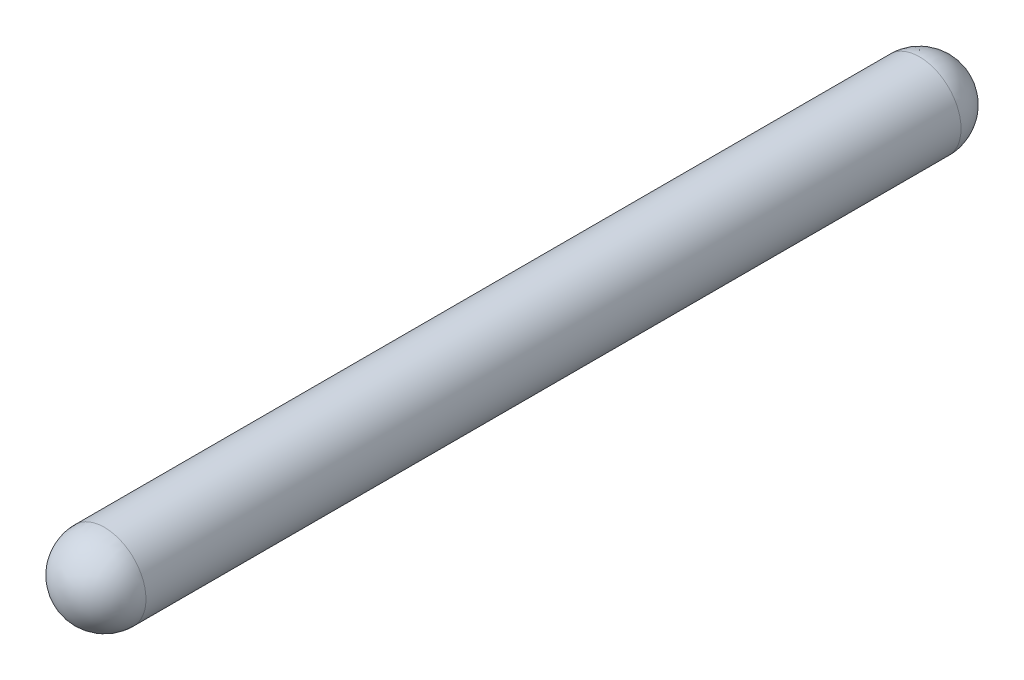
ISO-10303-21;
HEADER;
FILE_DESCRIPTION(('STEP AP214'),'2;1');
FILE_NAME('part.step','',(''),(''),'','','');
FILE_SCHEMA(('AUTOMOTIVE_DESIGN { 1 0 10303 214 1 1 1 1 }'));
ENDSEC;
DATA;
#1=APPLICATION_CONTEXT('core data for automotive mechanical design processes');
#2=APPLICATION_PROTOCOL_DEFINITION('international standard','automotive_design',2000,#1);
#3=PRODUCT_CONTEXT('',#1,'mechanical');
#4=PRODUCT('Part','Part','',(#3));
#5=PRODUCT_RELATED_PRODUCT_CATEGORY('part','',(#4));
#6=PRODUCT_DEFINITION_FORMATION('','',#4);
#7=PRODUCT_DEFINITION_CONTEXT('part definition',#1,'design');
#8=PRODUCT_DEFINITION('design','',#6,#7);
#9=PRODUCT_DEFINITION_SHAPE('','',#8);
#10=(LENGTH_UNIT() NAMED_UNIT(*) SI_UNIT(.MILLI.,.METRE.));
#11=(NAMED_UNIT(*) PLANE_ANGLE_UNIT() SI_UNIT($,.RADIAN.));
#12=(NAMED_UNIT(*) SI_UNIT($,.STERADIAN.) SOLID_ANGLE_UNIT());
#13=UNCERTAINTY_MEASURE_WITH_UNIT(LENGTH_MEASURE(1.E-05),#10,'distance_accuracy_value','');
#14=(GEOMETRIC_REPRESENTATION_CONTEXT(3) GLOBAL_UNCERTAINTY_ASSIGNED_CONTEXT((#13)) GLOBAL_UNIT_ASSIGNED_CONTEXT((#10,
#11,#12)) REPRESENTATION_CONTEXT('',''));
#15=CARTESIAN_POINT('',(0.,0.,0.));
#16=DIRECTION('',(0.,0.,1.));
#17=DIRECTION('',(1.,0.,0.));
#18=AXIS2_PLACEMENT_3D('',#15,#16,#17);
#19=CARTESIAN_POINT('',(-0.936,-16.31,-3.));
#20=DIRECTION('',(1.,0.,0.));
#21=DIRECTION('',(0.,-1.,0.));
#22=AXIS2_PLACEMENT_3D('',#19,#20,#21);
#23=SPHERICAL_SURFACE('',#22,0.331);
#24=CARTESIAN_POINT('',(-0.936,-16.31,-3.));
#25=DIRECTION('',(0.,0.,1.));
#26=DIRECTION('',(1.,0.,0.));
#27=AXIS2_PLACEMENT_3D('',#24,#25,#26);
#28=CIRCLE('',#27,0.331);
#29=CARTESIAN_POINT('',(-0.605,-16.31,-3.));
#30=VERTEX_POINT('',#29);
#31=CARTESIAN_POINT('',(-1.267,-16.31,-3.));
#32=VERTEX_POINT('',#31);
#33=EDGE_CURVE('E42',#30,#32,#28,.T.);
#34=ORIENTED_EDGE('',*,*,#33,.F.);
#35=CARTESIAN_POINT('',(-0.936,-16.31,-3.));
#36=DIRECTION('',(0.,0.,1.));
#37=DIRECTION('',(1.,0.,0.));
#38=AXIS2_PLACEMENT_3D('',#35,#36,#37);
#39=CIRCLE('',#38,0.331);
#40=EDGE_CURVE('E26',#32,#30,#39,.T.);
#41=ORIENTED_EDGE('',*,*,#40,.F.);
#42=EDGE_LOOP('',(#34,#41));
#43=FACE_BOUND('',#42,.T.);
#44=ADVANCED_FACE('F17',(#43),#23,.T.);
#45=CARTESIAN_POINT('',(-0.936,-16.31,3.5));
#46=DIRECTION('',(1.,0.,0.));
#47=DIRECTION('',(0.,1.,0.));
#48=AXIS2_PLACEMENT_3D('',#45,#46,#47);
#49=SPHERICAL_SURFACE('',#48,0.331);
#50=CARTESIAN_POINT('',(-0.936,-16.31,3.5));
#51=DIRECTION('',(0.,0.,1.));
#52=DIRECTION('',(1.,0.,0.));
#53=AXIS2_PLACEMENT_3D('',#50,#51,#52);
#54=CIRCLE('',#53,0.331);
#55=CARTESIAN_POINT('',(-0.605,-16.31,3.5));
#56=VERTEX_POINT('',#55);
#57=CARTESIAN_POINT('',(-1.267,-16.31,3.5));
#58=VERTEX_POINT('',#57);
#59=EDGE_CURVE('E11',#56,#58,#54,.F.);
#60=ORIENTED_EDGE('',*,*,#59,.F.);
#61=CARTESIAN_POINT('',(-0.936,-16.31,3.5));
#62=DIRECTION('',(0.,0.,1.));
#63=DIRECTION('',(1.,0.,0.));
#64=AXIS2_PLACEMENT_3D('',#61,#62,#63);
#65=CIRCLE('',#64,0.331);
#66=EDGE_CURVE('E34',#58,#56,#65,.F.);
#67=ORIENTED_EDGE('',*,*,#66,.F.);
#68=EDGE_LOOP('',(#60,#67));
#69=FACE_BOUND('',#68,.T.);
#70=ADVANCED_FACE('F49',(#69),#49,.T.);
#71=CARTESIAN_POINT('',(-0.936,-16.31,-3.));
#72=DIRECTION('',(0.,0.,1.));
#73=DIRECTION('',(1.,0.,0.));
#74=AXIS2_PLACEMENT_3D('',#71,#72,#73);
#75=CYLINDRICAL_SURFACE('',#74,0.331);
#76=ORIENTED_EDGE('',*,*,#66,.T.);
#77=ORIENTED_EDGE('',*,*,#59,.T.);
#78=EDGE_LOOP('',(#76,#77));
#79=FACE_BOUND('',#78,.T.);
#80=ORIENTED_EDGE('',*,*,#40,.T.);
#81=ORIENTED_EDGE('',*,*,#33,.T.);
#82=EDGE_LOOP('',(#80,#81));
#83=FACE_BOUND('',#82,.T.);
#84=ADVANCED_FACE('F45',(#79,#83),#75,.T.);
#85=CLOSED_SHELL('',(#44,#70,#84));
#86=MANIFOLD_SOLID_BREP('B1',#85);
#87=ADVANCED_BREP_SHAPE_REPRESENTATION('',(#18,#86),#14);
#88=SHAPE_DEFINITION_REPRESENTATION(#9,#87);
ENDSEC;
END-ISO-10303-21;
